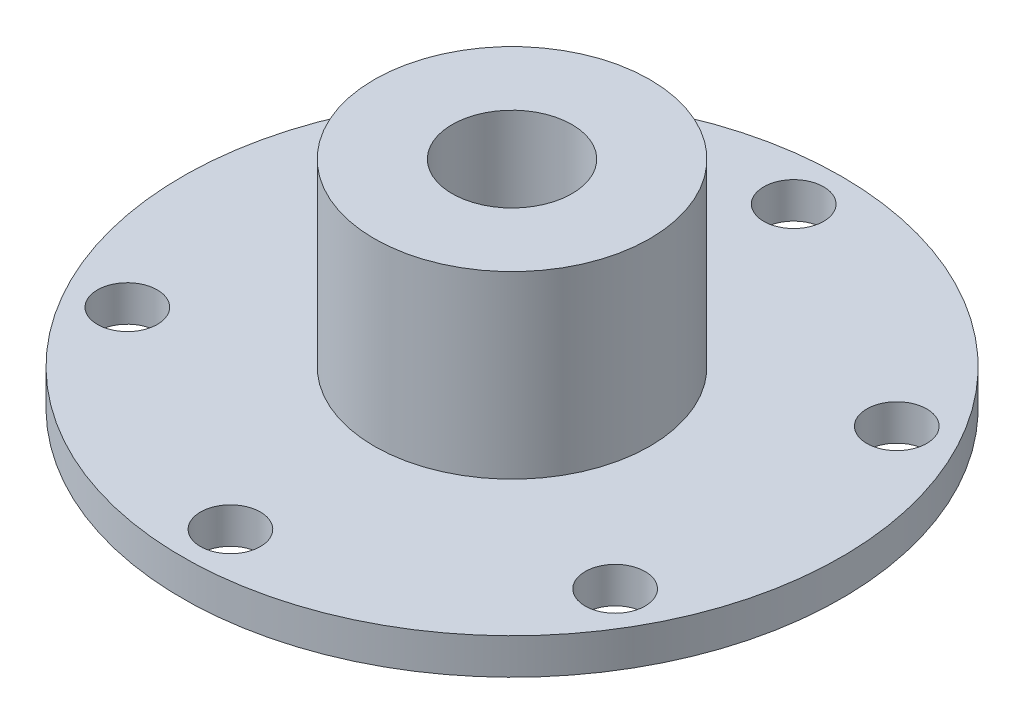
ISO-10303-21;
HEADER;
FILE_DESCRIPTION(('STEP AP214'),'2;1');
FILE_NAME('part.step','',(''),(''),'','','');
FILE_SCHEMA(('AUTOMOTIVE_DESIGN { 1 0 10303 214 1 1 1 1 }'));
ENDSEC;
DATA;
#1=APPLICATION_CONTEXT('core data for automotive mechanical design processes');
#2=APPLICATION_PROTOCOL_DEFINITION('international standard','automotive_design',2000,#1);
#3=PRODUCT_CONTEXT('',#1,'mechanical');
#4=PRODUCT('Part','Part','',(#3));
#5=PRODUCT_RELATED_PRODUCT_CATEGORY('part','',(#4));
#6=PRODUCT_DEFINITION_FORMATION('','',#4);
#7=PRODUCT_DEFINITION_CONTEXT('part definition',#1,'design');
#8=PRODUCT_DEFINITION('design','',#6,#7);
#9=PRODUCT_DEFINITION_SHAPE('','',#8);
#10=(LENGTH_UNIT() NAMED_UNIT(*) SI_UNIT(.MILLI.,.METRE.));
#11=(NAMED_UNIT(*) PLANE_ANGLE_UNIT() SI_UNIT($,.RADIAN.));
#12=(NAMED_UNIT(*) SI_UNIT($,.STERADIAN.) SOLID_ANGLE_UNIT());
#13=UNCERTAINTY_MEASURE_WITH_UNIT(LENGTH_MEASURE(1.E-05),#10,'distance_accuracy_value','');
#14=(GEOMETRIC_REPRESENTATION_CONTEXT(3) GLOBAL_UNCERTAINTY_ASSIGNED_CONTEXT((#13)) GLOBAL_UNIT_ASSIGNED_CONTEXT((#10,
#11,#12)) REPRESENTATION_CONTEXT('',''));
#15=CARTESIAN_POINT('',(0.,0.,0.));
#16=DIRECTION('',(0.,0.,1.));
#17=DIRECTION('',(1.,0.,0.));
#18=AXIS2_PLACEMENT_3D('',#15,#16,#17);
#19=CARTESIAN_POINT('',(0.,3.,0.));
#20=DIRECTION('',(0.,1.,0.));
#21=DIRECTION('',(0.,0.,-1.));
#22=AXIS2_PLACEMENT_3D('',#19,#20,#21);
#23=PLANE('',#22);
#24=CARTESIAN_POINT('',(-20.3515969889342,3.,11.7500000000002));
#25=DIRECTION('',(0.,-1.,0.));
#26=DIRECTION('',(0.,0.,-1.));
#27=AXIS2_PLACEMENT_3D('',#24,#25,#26);
#28=CIRCLE('',#27,2.5);
#29=CARTESIAN_POINT('',(-20.3515969889342,3.,9.25000000000023));
#30=VERTEX_POINT('',#29);
#31=EDGE_CURVE('E78',#30,#30,#28,.T.);
#32=ORIENTED_EDGE('',*,*,#31,.T.);
#33=EDGE_LOOP('',(#32));
#34=FACE_BOUND('',#33,.T.);
#35=CARTESIAN_POINT('',(-1.62069135962672E-13,3.,-23.5));
#36=DIRECTION('',(0.,-1.,0.));
#37=DIRECTION('',(0.,0.,-1.));
#38=AXIS2_PLACEMENT_3D('',#35,#36,#37);
#39=CIRCLE('',#38,2.5);
#40=CARTESIAN_POINT('',(-1.62069135962672E-13,3.,-26.));
#41=VERTEX_POINT('',#40);
#42=EDGE_CURVE('E66',#41,#41,#39,.T.);
#43=ORIENTED_EDGE('',*,*,#42,.T.);
#44=EDGE_LOOP('',(#43));
#45=FACE_BOUND('',#44,.T.);
#46=CARTESIAN_POINT('',(20.3515969889345,3.,11.7499999999997));
#47=DIRECTION('',(0.,-1.,0.));
#48=DIRECTION('',(0.,0.,-1.));
#49=AXIS2_PLACEMENT_3D('',#46,#47,#48);
#50=CIRCLE('',#49,2.5);
#51=CARTESIAN_POINT('',(20.3515969889345,3.,9.24999999999967));
#52=VERTEX_POINT('',#51);
#53=EDGE_CURVE('E54',#52,#52,#50,.T.);
#54=ORIENTED_EDGE('',*,*,#53,.T.);
#55=EDGE_LOOP('',(#54));
#56=FACE_BOUND('',#55,.T.);
#57=CARTESIAN_POINT('',(0.,3.,0.));
#58=DIRECTION('',(0.,-1.,0.));
#59=DIRECTION('',(0.,0.,-1.));
#60=AXIS2_PLACEMENT_3D('',#57,#58,#59);
#61=CIRCLE('',#60,27.5);
#62=CARTESIAN_POINT('',(0.,3.,-27.5));
#63=VERTEX_POINT('',#62);
#64=EDGE_CURVE('E10',#63,#63,#61,.T.);
#65=ORIENTED_EDGE('',*,*,#64,.F.);
#66=EDGE_LOOP('',(#65));
#67=FACE_BOUND('',#66,.T.);
#68=CARTESIAN_POINT('',(0.,3.,23.5));
#69=DIRECTION('',(0.,-1.,0.));
#70=DIRECTION('',(0.,0.,-1.));
#71=AXIS2_PLACEMENT_3D('',#68,#69,#70);
#72=CIRCLE('',#71,2.5);
#73=CARTESIAN_POINT('',(0.,3.,21.));
#74=VERTEX_POINT('',#73);
#75=EDGE_CURVE('E50',#74,#74,#72,.T.);
#76=ORIENTED_EDGE('',*,*,#75,.T.);
#77=EDGE_LOOP('',(#76));
#78=FACE_BOUND('',#77,.T.);
#79=CARTESIAN_POINT('',(20.3515969889341,3.,-11.7500000000004));
#80=DIRECTION('',(0.,-1.,0.));
#81=DIRECTION('',(0.,0.,-1.));
#82=AXIS2_PLACEMENT_3D('',#79,#80,#81);
#83=CIRCLE('',#82,2.5);
#84=CARTESIAN_POINT('',(20.3515969889341,3.,-14.2500000000004));
#85=VERTEX_POINT('',#84);
#86=EDGE_CURVE('E60',#85,#85,#83,.T.);
#87=ORIENTED_EDGE('',*,*,#86,.T.);
#88=EDGE_LOOP('',(#87));
#89=FACE_BOUND('',#88,.T.);
#90=CARTESIAN_POINT('',(-20.3515969889344,3.,-11.7499999999998));
#91=DIRECTION('',(0.,-1.,0.));
#92=DIRECTION('',(0.,0.,-1.));
#93=AXIS2_PLACEMENT_3D('',#90,#91,#92);
#94=CIRCLE('',#93,2.5);
#95=CARTESIAN_POINT('',(-20.3515969889344,3.,-14.2499999999998));
#96=VERTEX_POINT('',#95);
#97=EDGE_CURVE('E72',#96,#96,#94,.T.);
#98=ORIENTED_EDGE('',*,*,#97,.T.);
#99=EDGE_LOOP('',(#98));
#100=FACE_BOUND('',#99,.T.);
#101=CARTESIAN_POINT('',(0.,3.,0.));
#102=DIRECTION('',(0.,-1.,0.));
#103=DIRECTION('',(0.,0.,-1.));
#104=AXIS2_PLACEMENT_3D('',#101,#102,#103);
#105=CIRCLE('',#104,11.5);
#106=CARTESIAN_POINT('',(0.,3.,-11.5));
#107=VERTEX_POINT('',#106);
#108=EDGE_CURVE('E87',#107,#107,#105,.T.);
#109=ORIENTED_EDGE('',*,*,#108,.T.);
#110=EDGE_LOOP('',(#109));
#111=FACE_BOUND('',#110,.T.);
#112=ADVANCED_FACE('F35',(#34,#45,#56,#67,#78,#89,#100,#111),#23,.T.);
#113=CARTESIAN_POINT('',(0.,0.,0.));
#114=DIRECTION('',(0.,1.,0.));
#115=DIRECTION('',(0.,0.,-1.));
#116=AXIS2_PLACEMENT_3D('',#113,#114,#115);
#117=PLANE('',#116);
#118=CARTESIAN_POINT('',(0.,0.,0.));
#119=DIRECTION('',(0.,-1.,0.));
#120=DIRECTION('',(0.,0.,-1.));
#121=AXIS2_PLACEMENT_3D('',#118,#119,#120);
#122=CIRCLE('',#121,27.5);
#123=CARTESIAN_POINT('',(0.,0.,-27.5));
#124=VERTEX_POINT('',#123);
#125=EDGE_CURVE('E39',#124,#124,#122,.T.);
#126=ORIENTED_EDGE('',*,*,#125,.T.);
#127=EDGE_LOOP('',(#126));
#128=FACE_BOUND('',#127,.T.);
#129=CARTESIAN_POINT('',(0.,0.,0.));
#130=DIRECTION('',(0.,-1.,0.));
#131=DIRECTION('',(0.,0.,-1.));
#132=AXIS2_PLACEMENT_3D('',#129,#130,#131);
#133=CIRCLE('',#132,5.);
#134=CARTESIAN_POINT('',(0.,0.,-5.));
#135=VERTEX_POINT('',#134);
#136=EDGE_CURVE('E46',#135,#135,#133,.T.);
#137=ORIENTED_EDGE('',*,*,#136,.F.);
#138=EDGE_LOOP('',(#137));
#139=FACE_BOUND('',#138,.T.);
#140=CARTESIAN_POINT('',(0.,0.,23.5));
#141=DIRECTION('',(0.,-1.,0.));
#142=DIRECTION('',(0.,0.,-1.));
#143=AXIS2_PLACEMENT_3D('',#140,#141,#142);
#144=CIRCLE('',#143,2.5);
#145=CARTESIAN_POINT('',(0.,0.,21.));
#146=VERTEX_POINT('',#145);
#147=EDGE_CURVE('E51',#146,#146,#144,.T.);
#148=ORIENTED_EDGE('',*,*,#147,.F.);
#149=EDGE_LOOP('',(#148));
#150=FACE_BOUND('',#149,.T.);
#151=CARTESIAN_POINT('',(20.3515969889345,0.,11.7499999999997));
#152=DIRECTION('',(0.,-1.,0.));
#153=DIRECTION('',(0.,0.,-1.));
#154=AXIS2_PLACEMENT_3D('',#151,#152,#153);
#155=CIRCLE('',#154,2.5);
#156=CARTESIAN_POINT('',(20.3515969889345,0.,9.24999999999967));
#157=VERTEX_POINT('',#156);
#158=EDGE_CURVE('E57',#157,#157,#155,.T.);
#159=ORIENTED_EDGE('',*,*,#158,.F.);
#160=EDGE_LOOP('',(#159));
#161=FACE_BOUND('',#160,.T.);
#162=CARTESIAN_POINT('',(20.3515969889341,0.,-11.7500000000004));
#163=DIRECTION('',(0.,-1.,0.));
#164=DIRECTION('',(0.,0.,-1.));
#165=AXIS2_PLACEMENT_3D('',#162,#163,#164);
#166=CIRCLE('',#165,2.5);
#167=CARTESIAN_POINT('',(20.3515969889341,0.,-14.2500000000004));
#168=VERTEX_POINT('',#167);
#169=EDGE_CURVE('E63',#168,#168,#166,.T.);
#170=ORIENTED_EDGE('',*,*,#169,.F.);
#171=EDGE_LOOP('',(#170));
#172=FACE_BOUND('',#171,.T.);
#173=CARTESIAN_POINT('',(-1.62069135962672E-13,0.,-23.5));
#174=DIRECTION('',(0.,-1.,0.));
#175=DIRECTION('',(0.,0.,-1.));
#176=AXIS2_PLACEMENT_3D('',#173,#174,#175);
#177=CIRCLE('',#176,2.5);
#178=CARTESIAN_POINT('',(-1.62069135962672E-13,0.,-26.));
#179=VERTEX_POINT('',#178);
#180=EDGE_CURVE('E69',#179,#179,#177,.T.);
#181=ORIENTED_EDGE('',*,*,#180,.F.);
#182=EDGE_LOOP('',(#181));
#183=FACE_BOUND('',#182,.T.);
#184=CARTESIAN_POINT('',(-20.3515969889344,0.,-11.7499999999998));
#185=DIRECTION('',(0.,-1.,0.));
#186=DIRECTION('',(0.,0.,-1.));
#187=AXIS2_PLACEMENT_3D('',#184,#185,#186);
#188=CIRCLE('',#187,2.5);
#189=CARTESIAN_POINT('',(-20.3515969889344,0.,-14.2499999999998));
#190=VERTEX_POINT('',#189);
#191=EDGE_CURVE('E75',#190,#190,#188,.T.);
#192=ORIENTED_EDGE('',*,*,#191,.F.);
#193=EDGE_LOOP('',(#192));
#194=FACE_BOUND('',#193,.T.);
#195=CARTESIAN_POINT('',(-20.3515969889342,0.,11.7500000000002));
#196=DIRECTION('',(0.,-1.,0.));
#197=DIRECTION('',(0.,0.,-1.));
#198=AXIS2_PLACEMENT_3D('',#195,#196,#197);
#199=CIRCLE('',#198,2.5);
#200=CARTESIAN_POINT('',(-20.3515969889342,0.,9.25000000000023));
#201=VERTEX_POINT('',#200);
#202=EDGE_CURVE('E81',#201,#201,#199,.T.);
#203=ORIENTED_EDGE('',*,*,#202,.F.);
#204=EDGE_LOOP('',(#203));
#205=FACE_BOUND('',#204,.T.);
#206=ADVANCED_FACE('F110',(#128,#139,#150,#161,#172,#183,#194,#205),#117,.F.);
#207=CARTESIAN_POINT('',(0.,3.,0.));
#208=DIRECTION('',(0.,-1.,0.));
#209=DIRECTION('',(0.,0.,1.));
#210=AXIS2_PLACEMENT_3D('',#207,#208,#209);
#211=CYLINDRICAL_SURFACE('',#210,27.5);
#212=ORIENTED_EDGE('',*,*,#64,.T.);
#213=EDGE_LOOP('',(#212));
#214=FACE_BOUND('',#213,.T.);
#215=ORIENTED_EDGE('',*,*,#125,.F.);
#216=EDGE_LOOP('',(#215));
#217=FACE_BOUND('',#216,.T.);
#218=ADVANCED_FACE('F37',(#214,#217),#211,.T.);
#219=CARTESIAN_POINT('',(0.,3.,0.));
#220=DIRECTION('',(0.,-1.,0.));
#221=DIRECTION('',(0.,0.,1.));
#222=AXIS2_PLACEMENT_3D('',#219,#220,#221);
#223=CYLINDRICAL_SURFACE('',#222,5.);
#224=ORIENTED_EDGE('',*,*,#136,.T.);
#225=EDGE_LOOP('',(#224));
#226=FACE_BOUND('',#225,.T.);
#227=CARTESIAN_POINT('',(0.,18.,0.));
#228=DIRECTION('',(0.,-1.,0.));
#229=DIRECTION('',(0.,0.,-1.));
#230=AXIS2_PLACEMENT_3D('',#227,#228,#229);
#231=CIRCLE('',#230,5.);
#232=CARTESIAN_POINT('',(0.,18.,-5.));
#233=VERTEX_POINT('',#232);
#234=EDGE_CURVE('E90',#233,#233,#231,.T.);
#235=ORIENTED_EDGE('',*,*,#234,.F.);
#236=EDGE_LOOP('',(#235));
#237=FACE_BOUND('',#236,.T.);
#238=ADVANCED_FACE('F98',(#226,#237),#223,.F.);
#239=CARTESIAN_POINT('',(0.,3.,23.5));
#240=DIRECTION('',(0.,-1.,0.));
#241=DIRECTION('',(0.,0.,1.));
#242=AXIS2_PLACEMENT_3D('',#239,#240,#241);
#243=CYLINDRICAL_SURFACE('',#242,2.5);
#244=ORIENTED_EDGE('',*,*,#75,.F.);
#245=EDGE_LOOP('',(#244));
#246=FACE_BOUND('',#245,.T.);
#247=ORIENTED_EDGE('',*,*,#147,.T.);
#248=EDGE_LOOP('',(#247));
#249=FACE_BOUND('',#248,.T.);
#250=ADVANCED_FACE('F100',(#246,#249),#243,.F.);
#251=CARTESIAN_POINT('',(20.3515969889345,3.,11.7499999999997));
#252=DIRECTION('',(0.,-1.,0.));
#253=DIRECTION('',(0.,0.,1.));
#254=AXIS2_PLACEMENT_3D('',#251,#252,#253);
#255=CYLINDRICAL_SURFACE('',#254,2.5);
#256=ORIENTED_EDGE('',*,*,#53,.F.);
#257=EDGE_LOOP('',(#256));
#258=FACE_BOUND('',#257,.T.);
#259=ORIENTED_EDGE('',*,*,#158,.T.);
#260=EDGE_LOOP('',(#259));
#261=FACE_BOUND('',#260,.T.);
#262=ADVANCED_FACE('F107',(#258,#261),#255,.F.);
#263=CARTESIAN_POINT('',(20.3515969889341,3.,-11.7500000000004));
#264=DIRECTION('',(0.,-1.,0.));
#265=DIRECTION('',(0.,0.,1.));
#266=AXIS2_PLACEMENT_3D('',#263,#264,#265);
#267=CYLINDRICAL_SURFACE('',#266,2.5);
#268=ORIENTED_EDGE('',*,*,#86,.F.);
#269=EDGE_LOOP('',(#268));
#270=FACE_BOUND('',#269,.T.);
#271=ORIENTED_EDGE('',*,*,#169,.T.);
#272=EDGE_LOOP('',(#271));
#273=FACE_BOUND('',#272,.T.);
#274=ADVANCED_FACE('F154',(#270,#273),#267,.F.);
#275=CARTESIAN_POINT('',(-1.62069135962672E-13,3.,-23.5));
#276=DIRECTION('',(0.,-1.,0.));
#277=DIRECTION('',(0.,0.,1.));
#278=AXIS2_PLACEMENT_3D('',#275,#276,#277);
#279=CYLINDRICAL_SURFACE('',#278,2.5);
#280=ORIENTED_EDGE('',*,*,#42,.F.);
#281=EDGE_LOOP('',(#280));
#282=FACE_BOUND('',#281,.T.);
#283=ORIENTED_EDGE('',*,*,#180,.T.);
#284=EDGE_LOOP('',(#283));
#285=FACE_BOUND('',#284,.T.);
#286=ADVANCED_FACE('F150',(#282,#285),#279,.F.);
#287=CARTESIAN_POINT('',(-20.3515969889344,3.,-11.7499999999998));
#288=DIRECTION('',(0.,-1.,0.));
#289=DIRECTION('',(0.,0.,1.));
#290=AXIS2_PLACEMENT_3D('',#287,#288,#289);
#291=CYLINDRICAL_SURFACE('',#290,2.5);
#292=ORIENTED_EDGE('',*,*,#97,.F.);
#293=EDGE_LOOP('',(#292));
#294=FACE_BOUND('',#293,.T.);
#295=ORIENTED_EDGE('',*,*,#191,.T.);
#296=EDGE_LOOP('',(#295));
#297=FACE_BOUND('',#296,.T.);
#298=ADVANCED_FACE('F146',(#294,#297),#291,.F.);
#299=CARTESIAN_POINT('',(-20.3515969889342,3.,11.7500000000002));
#300=DIRECTION('',(0.,-1.,0.));
#301=DIRECTION('',(0.,0.,1.));
#302=AXIS2_PLACEMENT_3D('',#299,#300,#301);
#303=CYLINDRICAL_SURFACE('',#302,2.5);
#304=ORIENTED_EDGE('',*,*,#31,.F.);
#305=EDGE_LOOP('',(#304));
#306=FACE_BOUND('',#305,.T.);
#307=ORIENTED_EDGE('',*,*,#202,.T.);
#308=EDGE_LOOP('',(#307));
#309=FACE_BOUND('',#308,.T.);
#310=ADVANCED_FACE('F140',(#306,#309),#303,.F.);
#311=CARTESIAN_POINT('',(0.,18.,0.));
#312=DIRECTION('',(0.,1.,0.));
#313=DIRECTION('',(0.,0.,-1.));
#314=AXIS2_PLACEMENT_3D('',#311,#312,#313);
#315=PLANE('',#314);
#316=CARTESIAN_POINT('',(0.,18.,0.));
#317=DIRECTION('',(0.,-1.,0.));
#318=DIRECTION('',(0.,0.,-1.));
#319=AXIS2_PLACEMENT_3D('',#316,#317,#318);
#320=CIRCLE('',#319,11.5);
#321=CARTESIAN_POINT('',(0.,18.,-11.5));
#322=VERTEX_POINT('',#321);
#323=EDGE_CURVE('E84',#322,#322,#320,.T.);
#324=ORIENTED_EDGE('',*,*,#323,.F.);
#325=EDGE_LOOP('',(#324));
#326=FACE_BOUND('',#325,.T.);
#327=ORIENTED_EDGE('',*,*,#234,.T.);
#328=EDGE_LOOP('',(#327));
#329=FACE_BOUND('',#328,.T.);
#330=ADVANCED_FACE('F96',(#326,#329),#315,.T.);
#331=CARTESIAN_POINT('',(0.,18.,0.));
#332=DIRECTION('',(0.,-1.,0.));
#333=DIRECTION('',(0.,0.,1.));
#334=AXIS2_PLACEMENT_3D('',#331,#332,#333);
#335=CYLINDRICAL_SURFACE('',#334,11.5);
#336=ORIENTED_EDGE('',*,*,#323,.T.);
#337=EDGE_LOOP('',(#336));
#338=FACE_BOUND('',#337,.T.);
#339=ORIENTED_EDGE('',*,*,#108,.F.);
#340=EDGE_LOOP('',(#339));
#341=FACE_BOUND('',#340,.T.);
#342=ADVANCED_FACE('F133',(#338,#341),#335,.T.);
#343=CLOSED_SHELL('',(#112,#206,#218,#238,#250,#262,#274,#286,#298,#310,#330,#342));
#344=MANIFOLD_SOLID_BREP('B2',#343);
#345=ADVANCED_BREP_SHAPE_REPRESENTATION('',(#18,#344),#14);
#346=SHAPE_DEFINITION_REPRESENTATION(#9,#345);
ENDSEC;
END-ISO-10303-21;
